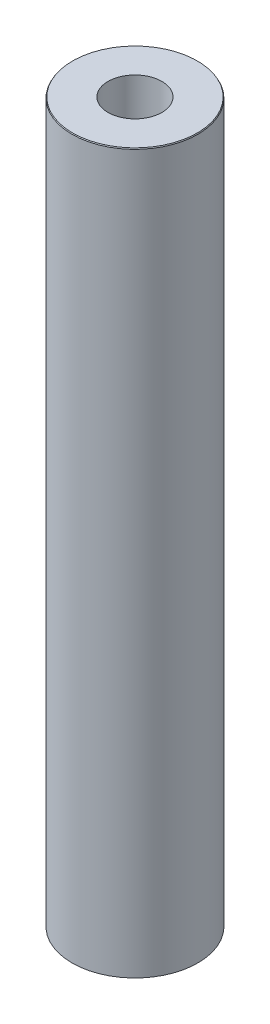
ISO-10303-21;
HEADER;
FILE_DESCRIPTION(('STEP AP214'),'2;1');
FILE_NAME('part.step','',(''),(''),'','','');
FILE_SCHEMA(('AUTOMOTIVE_DESIGN { 1 0 10303 214 1 1 1 1 }'));
ENDSEC;
DATA;
#1=APPLICATION_CONTEXT('core data for automotive mechanical design processes');
#2=APPLICATION_PROTOCOL_DEFINITION('international standard','automotive_design',2000,#1);
#3=PRODUCT_CONTEXT('',#1,'mechanical');
#4=PRODUCT('Part','Part','',(#3));
#5=PRODUCT_RELATED_PRODUCT_CATEGORY('part','',(#4));
#6=PRODUCT_DEFINITION_FORMATION('','',#4);
#7=PRODUCT_DEFINITION_CONTEXT('part definition',#1,'design');
#8=PRODUCT_DEFINITION('design','',#6,#7);
#9=PRODUCT_DEFINITION_SHAPE('','',#8);
#10=(LENGTH_UNIT() NAMED_UNIT(*) SI_UNIT(.MILLI.,.METRE.));
#11=(NAMED_UNIT(*) PLANE_ANGLE_UNIT() SI_UNIT($,.RADIAN.));
#12=(NAMED_UNIT(*) SI_UNIT($,.STERADIAN.) SOLID_ANGLE_UNIT());
#13=UNCERTAINTY_MEASURE_WITH_UNIT(LENGTH_MEASURE(1.E-05),#10,'distance_accuracy_value','');
#14=(GEOMETRIC_REPRESENTATION_CONTEXT(3) GLOBAL_UNCERTAINTY_ASSIGNED_CONTEXT((#13)) GLOBAL_UNIT_ASSIGNED_CONTEXT((#10,
#11,#12)) REPRESENTATION_CONTEXT('',''));
#15=CARTESIAN_POINT('',(0.,0.,0.));
#16=DIRECTION('',(0.,0.,1.));
#17=DIRECTION('',(1.,0.,0.));
#18=AXIS2_PLACEMENT_3D('',#15,#16,#17);
#19=CARTESIAN_POINT('',(0.,600.,0.));
#20=DIRECTION('',(0.,-1.,0.));
#21=DIRECTION('',(0.,0.,-1.));
#22=AXIS2_PLACEMENT_3D('',#19,#20,#21);
#23=CYLINDRICAL_SURFACE('',#22,52.5);
#24=CARTESIAN_POINT('',(0.,599.22518702929,0.));
#25=DIRECTION('',(0.,1.,0.));
#26=DIRECTION('',(0.,0.,1.));
#27=AXIS2_PLACEMENT_3D('',#24,#25,#26);
#28=CIRCLE('',#27,52.5);
#29=CARTESIAN_POINT('',(0.,599.22518702929,52.5));
#30=VERTEX_POINT('',#29);
#31=EDGE_CURVE('E50',#30,#30,#28,.F.);
#32=ORIENTED_EDGE('',*,*,#31,.T.);
#33=EDGE_LOOP('',(#32));
#34=FACE_BOUND('',#33,.T.);
#35=CARTESIAN_POINT('',(0.,0.447338477210901,0.));
#36=DIRECTION('',(0.,1.,0.));
#37=DIRECTION('',(0.,0.,1.));
#38=AXIS2_PLACEMENT_3D('',#35,#36,#37);
#39=CIRCLE('',#38,52.5);
#40=CARTESIAN_POINT('',(0.,0.447338477210901,52.5));
#41=VERTEX_POINT('',#40);
#42=EDGE_CURVE('E51',#41,#41,#39,.T.);
#43=ORIENTED_EDGE('',*,*,#42,.T.);
#44=EDGE_LOOP('',(#43));
#45=FACE_BOUND('',#44,.T.);
#46=ADVANCED_FACE('F39',(#34,#45),#23,.T.);
#47=CARTESIAN_POINT('',(0.,600.,0.));
#48=DIRECTION('',(0.,1.,0.));
#49=DIRECTION('',(0.,0.,1.));
#50=AXIS2_PLACEMENT_3D('',#47,#48,#49);
#51=PLANE('',#50);
#52=CARTESIAN_POINT('',(0.,600.,0.));
#53=DIRECTION('',(0.,1.,0.));
#54=DIRECTION('',(0.,0.,1.));
#55=AXIS2_PLACEMENT_3D('',#52,#53,#54);
#56=CIRCLE('',#55,52.0526615227891);
#57=CARTESIAN_POINT('',(0.,600.,52.0526615227891));
#58=VERTEX_POINT('',#57);
#59=EDGE_CURVE('E54',#58,#58,#56,.T.);
#60=ORIENTED_EDGE('',*,*,#59,.T.);
#61=EDGE_LOOP('',(#60));
#62=FACE_BOUND('',#61,.T.);
#63=CARTESIAN_POINT('',(0.,600.,0.));
#64=DIRECTION('',(0.,1.,0.));
#65=DIRECTION('',(0.,0.,1.));
#66=AXIS2_PLACEMENT_3D('',#63,#64,#65);
#67=CIRCLE('',#66,22.477222421756);
#68=CARTESIAN_POINT('',(0.,600.,22.477222421756));
#69=VERTEX_POINT('',#68);
#70=EDGE_CURVE('E58',#69,#69,#67,.T.);
#71=ORIENTED_EDGE('',*,*,#70,.F.);
#72=EDGE_LOOP('',(#71));
#73=FACE_BOUND('',#72,.T.);
#74=ADVANCED_FACE('F69',(#62,#73),#51,.T.);
#75=CARTESIAN_POINT('',(0.,0.,0.));
#76=DIRECTION('',(0.,1.,0.));
#77=DIRECTION('',(0.,0.,1.));
#78=AXIS2_PLACEMENT_3D('',#75,#76,#77);
#79=PLANE('',#78);
#80=CARTESIAN_POINT('',(0.,0.,0.));
#81=DIRECTION('',(0.,1.,0.));
#82=DIRECTION('',(0.,0.,1.));
#83=AXIS2_PLACEMENT_3D('',#80,#81,#82);
#84=CIRCLE('',#83,51.7251870292901);
#85=CARTESIAN_POINT('',(0.,0.,51.7251870292901));
#86=VERTEX_POINT('',#85);
#87=EDGE_CURVE('E10',#86,#86,#84,.F.);
#88=ORIENTED_EDGE('',*,*,#87,.T.);
#89=EDGE_LOOP('',(#88));
#90=FACE_BOUND('',#89,.T.);
#91=CARTESIAN_POINT('',(0.,0.,0.));
#92=DIRECTION('',(0.,1.,0.));
#93=DIRECTION('',(0.,0.,1.));
#94=AXIS2_PLACEMENT_3D('',#91,#92,#93);
#95=CIRCLE('',#94,22.477222421756);
#96=CARTESIAN_POINT('',(0.,0.,22.477222421756));
#97=VERTEX_POINT('',#96);
#98=EDGE_CURVE('E63',#97,#97,#95,.T.);
#99=ORIENTED_EDGE('',*,*,#98,.T.);
#100=EDGE_LOOP('',(#99));
#101=FACE_BOUND('',#100,.T.);
#102=ADVANCED_FACE('F75',(#90,#101),#79,.F.);
#103=CARTESIAN_POINT('',(0.,600.,0.));
#104=DIRECTION('',(0.,-1.,0.));
#105=DIRECTION('',(0.,0.,-1.));
#106=AXIS2_PLACEMENT_3D('',#103,#104,#105);
#107=CYLINDRICAL_SURFACE('',#106,22.477222421756);
#108=ORIENTED_EDGE('',*,*,#70,.T.);
#109=EDGE_LOOP('',(#108));
#110=FACE_BOUND('',#109,.T.);
#111=ORIENTED_EDGE('',*,*,#98,.F.);
#112=EDGE_LOOP('',(#111));
#113=FACE_BOUND('',#112,.T.);
#114=ADVANCED_FACE('F70',(#110,#113),#107,.F.);
#115=CARTESIAN_POINT('',(0.,600.,0.));
#116=DIRECTION('',(0.,-1.,0.));
#117=DIRECTION('',(0.,0.,-1.));
#118=AXIS2_PLACEMENT_3D('',#115,#116,#117);
#119=CONICAL_SURFACE('',#118,52.0526615227891,0.523598775598288);
#120=ORIENTED_EDGE('',*,*,#31,.F.);
#121=EDGE_LOOP('',(#120));
#122=FACE_BOUND('',#121,.T.);
#123=ORIENTED_EDGE('',*,*,#59,.F.);
#124=EDGE_LOOP('',(#123));
#125=FACE_BOUND('',#124,.T.);
#126=ADVANCED_FACE('F81',(#122,#125),#119,.T.);
#127=CARTESIAN_POINT('',(0.,0.447338477210901,0.));
#128=DIRECTION('',(0.,1.,0.));
#129=DIRECTION('',(0.,0.,1.));
#130=AXIS2_PLACEMENT_3D('',#127,#128,#129);
#131=CONICAL_SURFACE('',#130,52.5,1.04719755119665);
#132=ORIENTED_EDGE('',*,*,#87,.F.);
#133=EDGE_LOOP('',(#132));
#134=FACE_BOUND('',#133,.T.);
#135=ORIENTED_EDGE('',*,*,#42,.F.);
#136=EDGE_LOOP('',(#135));
#137=FACE_BOUND('',#136,.T.);
#138=ADVANCED_FACE('F45',(#134,#137),#131,.T.);
#139=CLOSED_SHELL('',(#46,#74,#102,#114,#126,#138));
#140=MANIFOLD_SOLID_BREP('B2',#139);
#141=ADVANCED_BREP_SHAPE_REPRESENTATION('',(#18,#140),#14);
#142=SHAPE_DEFINITION_REPRESENTATION(#9,#141);
ENDSEC;
END-ISO-10303-21;
